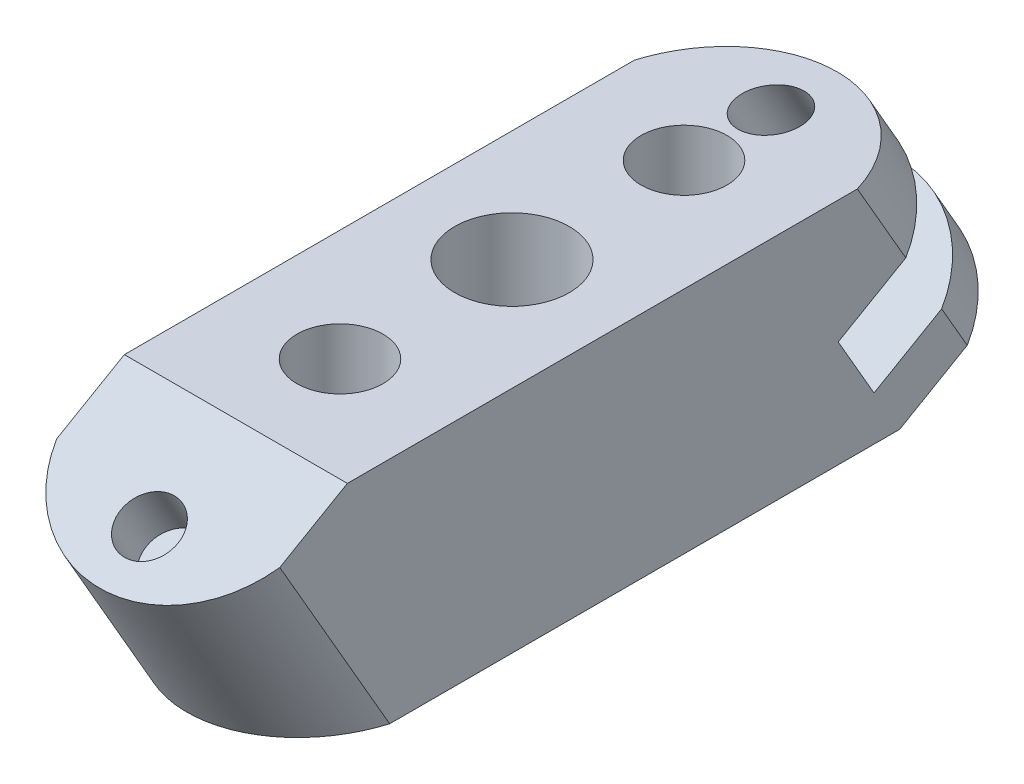
ISO-10303-21;
HEADER;
FILE_DESCRIPTION(('STEP AP214'),'2;1');
FILE_NAME('part.step','',(''),(''),'','','');
FILE_SCHEMA(('AUTOMOTIVE_DESIGN { 1 0 10303 214 1 1 1 1 }'));
ENDSEC;
DATA;
#1=APPLICATION_CONTEXT('core data for automotive mechanical design processes');
#2=APPLICATION_PROTOCOL_DEFINITION('international standard','automotive_design',2000,#1);
#3=PRODUCT_CONTEXT('',#1,'mechanical');
#4=PRODUCT('Part','Part','',(#3));
#5=PRODUCT_RELATED_PRODUCT_CATEGORY('part','',(#4));
#6=PRODUCT_DEFINITION_FORMATION('','',#4);
#7=PRODUCT_DEFINITION_CONTEXT('part definition',#1,'design');
#8=PRODUCT_DEFINITION('design','',#6,#7);
#9=PRODUCT_DEFINITION_SHAPE('','',#8);
#10=(LENGTH_UNIT() NAMED_UNIT(*) SI_UNIT(.MILLI.,.METRE.));
#11=(NAMED_UNIT(*) PLANE_ANGLE_UNIT() SI_UNIT($,.RADIAN.));
#12=(NAMED_UNIT(*) SI_UNIT($,.STERADIAN.) SOLID_ANGLE_UNIT());
#13=UNCERTAINTY_MEASURE_WITH_UNIT(LENGTH_MEASURE(1.E-05),#10,'distance_accuracy_value','');
#14=(GEOMETRIC_REPRESENTATION_CONTEXT(3) GLOBAL_UNCERTAINTY_ASSIGNED_CONTEXT((#13)) GLOBAL_UNIT_ASSIGNED_CONTEXT((#10,
#11,#12)) REPRESENTATION_CONTEXT('',''));
#15=CARTESIAN_POINT('',(0.,0.,0.));
#16=DIRECTION('',(0.,0.,1.));
#17=DIRECTION('',(1.,0.,0.));
#18=AXIS2_PLACEMENT_3D('',#15,#16,#17);
#19=CARTESIAN_POINT('',(0.,0.,0.));
#20=DIRECTION('',(0.,1.,0.));
#21=DIRECTION('',(0.,0.,1.));
#22=AXIS2_PLACEMENT_3D('',#19,#20,#21);
#23=PLANE('',#22);
#24=CARTESIAN_POINT('',(0.,0.,9.03248212926257));
#25=DIRECTION('',(0.,-1.,0.));
#26=DIRECTION('',(0.,0.,1.));
#27=AXIS2_PLACEMENT_3D('',#24,#25,#26);
#28=ELLIPSE('',#27,1.15470053837925,1.);
#29=CARTESIAN_POINT('',(0.,0.,10.1871826676418));
#30=VERTEX_POINT('',#29);
#31=EDGE_CURVE('E211',#30,#30,#28,.F.);
#32=ORIENTED_EDGE('',*,*,#31,.T.);
#33=EDGE_LOOP('',(#32));
#34=FACE_BOUND('',#33,.T.);
#35=CARTESIAN_POINT('',(0.,0.,-6.));
#36=DIRECTION('',(0.,1.,0.));
#37=DIRECTION('',(0.,0.,1.));
#38=AXIS2_PLACEMENT_3D('',#35,#36,#37);
#39=CIRCLE('',#38,1.5);
#40=CARTESIAN_POINT('',(0.,0.,-4.5));
#41=VERTEX_POINT('',#40);
#42=EDGE_CURVE('E195',#41,#41,#39,.F.);
#43=ORIENTED_EDGE('',*,*,#42,.F.);
#44=EDGE_LOOP('',(#43));
#45=FACE_BOUND('',#44,.T.);
#46=CARTESIAN_POINT('',(0.,0.,0.));
#47=DIRECTION('',(0.,1.,0.));
#48=DIRECTION('',(0.,0.,1.));
#49=AXIS2_PLACEMENT_3D('',#46,#47,#48);
#50=CIRCLE('',#49,2.);
#51=CARTESIAN_POINT('',(0.,0.,2.));
#52=VERTEX_POINT('',#51);
#53=EDGE_CURVE('E277',#52,#52,#50,.F.);
#54=ORIENTED_EDGE('',*,*,#53,.F.);
#55=EDGE_LOOP('',(#54));
#56=FACE_BOUND('',#55,.T.);
#57=CARTESIAN_POINT('',(0.,0.,6.));
#58=DIRECTION('',(0.,1.,0.));
#59=DIRECTION('',(0.,0.,1.));
#60=AXIS2_PLACEMENT_3D('',#57,#58,#59);
#61=CIRCLE('',#60,1.5);
#62=CARTESIAN_POINT('',(0.,0.,7.5));
#63=VERTEX_POINT('',#62);
#64=EDGE_CURVE('E283',#63,#63,#61,.F.);
#65=ORIENTED_EDGE('',*,*,#64,.F.);
#66=EDGE_LOOP('',(#65));
#67=FACE_BOUND('',#66,.T.);
#68=DIRECTION('',(0.,0.,-1.));
#69=VECTOR('',#68,1.);
#70=CARTESIAN_POINT('',(3.8891925564144,0.,15.960685359538));
#71=LINE('',#70,#69);
#72=CARTESIAN_POINT('',(3.8891925564144,0.,8.15562472071067));
#73=VERTEX_POINT('',#72);
#74=CARTESIAN_POINT('',(3.8891925564144,0.,-9.63108014573055));
#75=VERTEX_POINT('',#74);
#76=EDGE_CURVE('E183',#73,#75,#71,.T.);
#77=ORIENTED_EDGE('',*,*,#76,.F.);
#78=CARTESIAN_POINT('',(0.,0.,6.58395135646211));
#79=DIRECTION('',(0.,1.,0.));
#80=DIRECTION('',(0.,0.,1.));
#81=AXIS2_PLACEMENT_3D('',#78,#79,#80);
#82=ELLIPSE('',#81,4.75793184955893,4.12048985119312);
#83=CARTESIAN_POINT('',(-3.8891925564144,0.,8.15562472071067));
#84=VERTEX_POINT('',#83);
#85=EDGE_CURVE('E168',#84,#73,#82,.T.);
#86=ORIENTED_EDGE('',*,*,#85,.F.);
#87=DIRECTION('',(0.,0.,1.));
#88=VECTOR('',#87,1.);
#89=CARTESIAN_POINT('',(-3.8891925564144,0.,15.960685359538));
#90=LINE('',#89,#88);
#91=CARTESIAN_POINT('',(-3.8891925564144,0.,-9.63108014573055));
#92=VERTEX_POINT('',#91);
#93=EDGE_CURVE('E190',#92,#84,#90,.T.);
#94=ORIENTED_EDGE('',*,*,#93,.F.);
#95=DIRECTION('',(-1.,0.,0.));
#96=VECTOR('',#95,1.);
#97=CARTESIAN_POINT('',(10.7867199262881,0.,-9.63108014573055));
#98=LINE('',#97,#96);
#99=EDGE_CURVE('E188',#75,#92,#98,.T.);
#100=ORIENTED_EDGE('',*,*,#99,.F.);
#101=EDGE_LOOP('',(#77,#86,#94,#100));
#102=FACE_BOUND('',#101,.T.);
#103=ADVANCED_FACE('F87',(#34,#45,#56,#67,#102),#23,.F.);
#104=CARTESIAN_POINT('',(10.7867199262881,5.25920054445814,14.3782840560862));
#105=DIRECTION('',(0.,-0.866025403784439,-0.5));
#106=DIRECTION('',(0.,0.5,-0.866025403784439));
#107=AXIS2_PLACEMENT_3D('',#104,#105,#106);
#108=PLANE('',#107);
#109=CARTESIAN_POINT('',(0.,6.25920054445815,12.6462332485173));
#110=DIRECTION('',(0.,0.86602540378444,0.499999999999998));
#111=DIRECTION('',(0.,-0.499999999999998,0.86602540378444));
#112=AXIS2_PLACEMENT_3D('',#109,#110,#111);
#113=CIRCLE('',#112,1.);
#114=CARTESIAN_POINT('',(0.,5.75920054445815,13.5122586523018));
#115=VERTEX_POINT('',#114);
#116=EDGE_CURVE('E506',#115,#115,#113,.T.);
#117=ORIENTED_EDGE('',*,*,#116,.F.);
#118=EDGE_LOOP('',(#117));
#119=FACE_BOUND('',#118,.T.);
#120=CARTESIAN_POINT('',(0.,7.3194454700547,10.809835168917));
#121=DIRECTION('',(0.,-0.866025403784439,-0.5));
#122=DIRECTION('',(0.,0.5,-0.866025403784439));
#123=AXIS2_PLACEMENT_3D('',#120,#121,#122);
#124=CIRCLE('',#123,4.12048985119312);
#125=CARTESIAN_POINT('',(3.8891925564144,6.63889094010939,11.9885901921034));
#126=VERTEX_POINT('',#125);
#127=CARTESIAN_POINT('',(-3.8891925564144,6.63889094010939,11.9885901921034));
#128=VERTEX_POINT('',#127);
#129=EDGE_CURVE('E95',#126,#128,#124,.T.);
#130=ORIENTED_EDGE('',*,*,#129,.F.);
#131=DIRECTION('',(0.,0.5,-0.866025403784439));
#132=VECTOR('',#131,1.);
#133=CARTESIAN_POINT('',(3.8891925564144,5.25920054445814,14.3782840560862));
#134=LINE('',#133,#132);
#135=CARTESIAN_POINT('',(3.8891925564144,8.,9.63108014573055));
#136=VERTEX_POINT('',#135);
#137=EDGE_CURVE('E186',#126,#136,#134,.T.);
#138=ORIENTED_EDGE('',*,*,#137,.T.);
#139=DIRECTION('',(-1.,0.,0.));
#140=VECTOR('',#139,1.);
#141=CARTESIAN_POINT('',(10.7867199262881,8.,9.63108014573055));
#142=LINE('',#141,#140);
#143=CARTESIAN_POINT('',(-3.8891925564144,8.,9.63108014573055));
#144=VERTEX_POINT('',#143);
#145=EDGE_CURVE('E215',#136,#144,#142,.T.);
#146=ORIENTED_EDGE('',*,*,#145,.T.);
#147=DIRECTION('',(0.,-0.5,0.866025403784439));
#148=VECTOR('',#147,1.);
#149=CARTESIAN_POINT('',(-3.8891925564144,5.25920054445814,14.3782840560862));
#150=LINE('',#149,#148);
#151=EDGE_CURVE('E178',#144,#128,#150,.T.);
#152=ORIENTED_EDGE('',*,*,#151,.T.);
#153=EDGE_LOOP('',(#130,#138,#146,#152));
#154=FACE_BOUND('',#153,.T.);
#155=ADVANCED_FACE('F213',(#119,#154),#108,.F.);
#156=CARTESIAN_POINT('',(3.8891925564144,8.,15.960685359538));
#157=DIRECTION('',(-1.,0.,0.));
#158=DIRECTION('',(0.,0.,1.));
#159=AXIS2_PLACEMENT_3D('',#156,#157,#158);
#160=PLANE('',#159);
#161=DIRECTION('',(0.,0.866025403784439,0.5));
#162=VECTOR('',#161,1.);
#163=CARTESIAN_POINT('',(3.8891925564144,-9.75746872363361,2.52214752651145));
#164=LINE('',#163,#162);
#165=EDGE_CURVE('E12',#73,#126,#164,.T.);
#166=ORIENTED_EDGE('',*,*,#165,.F.);
#167=ORIENTED_EDGE('',*,*,#76,.T.);
#168=DIRECTION('',(0.,-0.5,0.866025403784439));
#169=VECTOR('',#168,1.);
#170=CARTESIAN_POINT('',(3.8891925564144,2.74079945554186,-14.3782840560862));
#171=LINE('',#170,#169);
#172=CARTESIAN_POINT('',(3.8891925564144,1.3611090598906,-11.9885901921034));
#173=VERTEX_POINT('',#172);
#174=EDGE_CURVE('E268',#173,#75,#171,.T.);
#175=ORIENTED_EDGE('',*,*,#174,.F.);
#176=DIRECTION('',(0.,-0.86602540378444,-0.499999999999998));
#177=VECTOR('',#176,1.);
#178=CARTESIAN_POINT('',(3.8891925564144,11.7593636972333,-5.98515507813138));
#179=LINE('',#178,#177);
#180=CARTESIAN_POINT('',(3.8891925564144,2.90817757738913,-11.0953897670709));
#181=VERTEX_POINT('',#180);
#182=EDGE_CURVE('E253',#181,#173,#179,.T.);
#183=ORIENTED_EDGE('',*,*,#182,.F.);
#184=DIRECTION('',(0.,-0.499999999999998,0.86602540378444));
#185=VECTOR('',#184,1.);
#186=CARTESIAN_POINT('',(3.8891925564144,2.90817757738913,-11.0953897670709));
#187=LINE('',#186,#185);
#188=CARTESIAN_POINT('',(3.8891925564144,1.54706851749852,-8.73787972069799));
#189=VERTEX_POINT('',#188);
#190=EDGE_CURVE('E237',#181,#189,#187,.T.);
#191=ORIENTED_EDGE('',*,*,#190,.T.);
#192=DIRECTION('',(0.,0.86602540378444,0.499999999999998));
#193=VECTOR('',#192,1.);
#194=CARTESIAN_POINT('',(3.8891925564144,1.54706851749852,-8.73787972069799));
#195=LINE('',#194,#193);
#196=CARTESIAN_POINT('',(3.8891925564144,3.71213202695961,-7.487879720698));
#197=VERTEX_POINT('',#196);
#198=EDGE_CURVE('E248',#189,#197,#195,.T.);
#199=ORIENTED_EDGE('',*,*,#198,.T.);
#200=DIRECTION('',(0.,-0.499999999999998,0.86602540378444));
#201=VECTOR('',#200,1.);
#202=CARTESIAN_POINT('',(3.8891925564144,5.07324108685023,-9.84538976707086));
#203=LINE('',#202,#201);
#204=CARTESIAN_POINT('',(3.8891925564144,5.07324108685023,-9.84538976707086));
#205=VERTEX_POINT('',#204);
#206=EDGE_CURVE('E229',#205,#197,#203,.T.);
#207=ORIENTED_EDGE('',*,*,#206,.F.);
#208=CARTESIAN_POINT('',(3.8891925564144,8.,-8.15562472071071));
#209=VERTEX_POINT('',#208);
#210=EDGE_CURVE('E254',#209,#205,#179,.T.);
#211=ORIENTED_EDGE('',*,*,#210,.F.);
#212=DIRECTION('',(0.,0.,-1.));
#213=VECTOR('',#212,1.);
#214=CARTESIAN_POINT('',(3.8891925564144,8.,15.960685359538));
#215=LINE('',#214,#213);
#216=EDGE_CURVE('E193',#136,#209,#215,.T.);
#217=ORIENTED_EDGE('',*,*,#216,.F.);
#218=ORIENTED_EDGE('',*,*,#137,.F.);
#219=EDGE_LOOP('',(#166,#167,#175,#183,#191,#199,#207,#211,#217,#218));
#220=FACE_BOUND('',#219,.T.);
#221=ADVANCED_FACE('F181',(#220),#160,.F.);
#222=CARTESIAN_POINT('',(-3.8891925564144,8.,15.960685359538));
#223=DIRECTION('',(1.,0.,0.));
#224=DIRECTION('',(0.,0.,-1.));
#225=AXIS2_PLACEMENT_3D('',#222,#223,#224);
#226=PLANE('',#225);
#227=DIRECTION('',(0.,0.866025403784439,0.5));
#228=VECTOR('',#227,1.);
#229=CARTESIAN_POINT('',(-3.8891925564144,-9.75746872363361,2.52214752651145));
#230=LINE('',#229,#228);
#231=EDGE_CURVE('E173',#84,#128,#230,.T.);
#232=ORIENTED_EDGE('',*,*,#231,.T.);
#233=ORIENTED_EDGE('',*,*,#151,.F.);
#234=DIRECTION('',(0.,0.,1.));
#235=VECTOR('',#234,1.);
#236=CARTESIAN_POINT('',(-3.8891925564144,8.,15.960685359538));
#237=LINE('',#236,#235);
#238=CARTESIAN_POINT('',(-3.8891925564144,8.,-8.15562472071071));
#239=VERTEX_POINT('',#238);
#240=EDGE_CURVE('E189',#239,#144,#237,.T.);
#241=ORIENTED_EDGE('',*,*,#240,.F.);
#242=DIRECTION('',(0.,-0.86602540378444,-0.499999999999998));
#243=VECTOR('',#242,1.);
#244=CARTESIAN_POINT('',(-3.8891925564144,11.7593636972333,-5.98515507813138));
#245=LINE('',#244,#243);
#246=CARTESIAN_POINT('',(-3.8891925564144,5.07324108685023,-9.84538976707086));
#247=VERTEX_POINT('',#246);
#248=EDGE_CURVE('E264',#239,#247,#245,.T.);
#249=ORIENTED_EDGE('',*,*,#248,.T.);
#250=DIRECTION('',(0.,0.499999999999998,-0.86602540378444));
#251=VECTOR('',#250,1.);
#252=CARTESIAN_POINT('',(-3.8891925564144,3.71213202695961,-7.487879720698));
#253=LINE('',#252,#251);
#254=CARTESIAN_POINT('',(-3.8891925564144,3.71213202695961,-7.487879720698));
#255=VERTEX_POINT('',#254);
#256=EDGE_CURVE('E109',#255,#247,#253,.T.);
#257=ORIENTED_EDGE('',*,*,#256,.F.);
#258=DIRECTION('',(0.,0.86602540378444,0.499999999999998));
#259=VECTOR('',#258,1.);
#260=CARTESIAN_POINT('',(-3.8891925564144,1.54706851749852,-8.73787972069799));
#261=LINE('',#260,#259);
#262=CARTESIAN_POINT('',(-3.8891925564144,1.54706851749852,-8.73787972069799));
#263=VERTEX_POINT('',#262);
#264=EDGE_CURVE('E245',#263,#255,#261,.T.);
#265=ORIENTED_EDGE('',*,*,#264,.F.);
#266=DIRECTION('',(0.,0.499999999999998,-0.86602540378444));
#267=VECTOR('',#266,1.);
#268=CARTESIAN_POINT('',(-3.8891925564144,1.54706851749852,-8.73787972069799));
#269=LINE('',#268,#267);
#270=CARTESIAN_POINT('',(-3.8891925564144,2.90817757738913,-11.0953897670709));
#271=VERTEX_POINT('',#270);
#272=EDGE_CURVE('E242',#263,#271,#269,.T.);
#273=ORIENTED_EDGE('',*,*,#272,.T.);
#274=CARTESIAN_POINT('',(-3.8891925564144,1.3611090598906,-11.9885901921034));
#275=VERTEX_POINT('',#274);
#276=EDGE_CURVE('E263',#271,#275,#245,.T.);
#277=ORIENTED_EDGE('',*,*,#276,.T.);
#278=DIRECTION('',(0.,0.5,-0.866025403784439));
#279=VECTOR('',#278,1.);
#280=CARTESIAN_POINT('',(-3.8891925564144,2.74079945554186,-14.3782840560862));
#281=LINE('',#280,#279);
#282=EDGE_CURVE('E267',#92,#275,#281,.T.);
#283=ORIENTED_EDGE('',*,*,#282,.F.);
#284=ORIENTED_EDGE('',*,*,#93,.T.);
#285=EDGE_LOOP('',(#232,#233,#241,#249,#257,#265,#273,#277,#283,#284));
#286=FACE_BOUND('',#285,.T.);
#287=ADVANCED_FACE('F89',(#286),#226,.F.);
#288=CARTESIAN_POINT('',(0.,-5.65685424949238,-6.));
#289=DIRECTION('',(0.,1.,0.));
#290=DIRECTION('',(0.,0.,1.));
#291=AXIS2_PLACEMENT_3D('',#288,#289,#290);
#292=CYLINDRICAL_SURFACE('',#291,1.5);
#293=CARTESIAN_POINT('',(0.,8.,-6.));
#294=DIRECTION('',(0.,1.,0.));
#295=DIRECTION('',(0.,0.,1.));
#296=AXIS2_PLACEMENT_3D('',#293,#294,#295);
#297=CIRCLE('',#296,1.5);
#298=CARTESIAN_POINT('',(0.,8.,-4.5));
#299=VERTEX_POINT('',#298);
#300=EDGE_CURVE('E274',#299,#299,#297,.T.);
#301=ORIENTED_EDGE('',*,*,#300,.T.);
#302=EDGE_LOOP('',(#301));
#303=FACE_BOUND('',#302,.T.);
#304=ORIENTED_EDGE('',*,*,#42,.T.);
#305=EDGE_LOOP('',(#304));
#306=FACE_BOUND('',#305,.T.);
#307=CARTESIAN_POINT('',(0.,6.28921529875994,-6.));
#308=DIRECTION('',(0.,0.499999999999998,-0.86602540378444));
#309=DIRECTION('',(0.,0.86602540378444,0.499999999999998));
#310=AXIS2_PLACEMENT_3D('',#307,#308,#309);
#311=ELLIPSE('',#310,3.00000000000001,1.5);
#312=CARTESIAN_POINT('',(-0.190299597308189,3.71213202695961,-7.487879720698));
#313=VERTEX_POINT('',#312);
#314=CARTESIAN_POINT('',(0.190299597308189,3.71213202695961,-7.487879720698));
#315=VERTEX_POINT('',#314);
#316=EDGE_CURVE('E199',#313,#315,#311,.F.);
#317=ORIENTED_EDGE('',*,*,#316,.F.);
#318=CARTESIAN_POINT('',(0.,2.85310426969285,-6.));
#319=DIRECTION('',(0.,-0.86602540378444,-0.499999999999998));
#320=DIRECTION('',(0.,0.499999999999998,-0.86602540378444));
#321=AXIS2_PLACEMENT_3D('',#318,#319,#320);
#322=ELLIPSE('',#321,1.73205080756888,1.5);
#323=EDGE_CURVE('E251',#315,#313,#322,.F.);
#324=ORIENTED_EDGE('',*,*,#323,.F.);
#325=EDGE_LOOP('',(#317,#324));
#326=FACE_BOUND('',#325,.T.);
#327=ADVANCED_FACE('F344',(#303,#306,#326),#292,.F.);
#328=CARTESIAN_POINT('',(0.,11.078809167288,-4.80640005494495));
#329=DIRECTION('',(0.,-0.86602540378444,-0.499999999999998));
#330=DIRECTION('',(0.,0.499999999999998,-0.86602540378444));
#331=AXIS2_PLACEMENT_3D('',#328,#329,#330);
#332=CYLINDRICAL_SURFACE('',#331,4.12048985119312);
#333=CARTESIAN_POINT('',(0.,4.39268655690492,-8.66663474388443));
#334=DIRECTION('',(0.,-0.86602540378444,-0.499999999999998));
#335=DIRECTION('',(0.,0.499999999999998,-0.86602540378444));
#336=AXIS2_PLACEMENT_3D('',#333,#334,#335);
#337=CIRCLE('',#336,4.12048985119312);
#338=EDGE_CURVE('E227',#247,#205,#337,.T.);
#339=ORIENTED_EDGE('',*,*,#338,.F.);
#340=ORIENTED_EDGE('',*,*,#248,.F.);
#341=CARTESIAN_POINT('',(0.,8.,-6.58395135646214));
#342=DIRECTION('',(0.,1.,0.));
#343=DIRECTION('',(0.,0.,-1.));
#344=AXIS2_PLACEMENT_3D('',#341,#342,#343);
#345=ELLIPSE('',#344,4.75793184955893,4.12048985119312);
#346=EDGE_CURVE('E260',#209,#239,#345,.T.);
#347=ORIENTED_EDGE('',*,*,#346,.F.);
#348=ORIENTED_EDGE('',*,*,#210,.T.);
#349=EDGE_LOOP('',(#339,#340,#347,#348));
#350=FACE_BOUND('',#349,.T.);
#351=ADVANCED_FACE('F295',(#350),#332,.T.);
#352=CARTESIAN_POINT('',(0.,8.,0.));
#353=DIRECTION('',(0.,1.,0.));
#354=DIRECTION('',(0.,0.,1.));
#355=AXIS2_PLACEMENT_3D('',#352,#353,#354);
#356=PLANE('',#355);
#357=ORIENTED_EDGE('',*,*,#145,.F.);
#358=ORIENTED_EDGE('',*,*,#216,.T.);
#359=ORIENTED_EDGE('',*,*,#346,.T.);
#360=ORIENTED_EDGE('',*,*,#240,.T.);
#361=EDGE_LOOP('',(#357,#358,#359,#360));
#362=FACE_BOUND('',#361,.T.);
#363=CARTESIAN_POINT('',(0.,8.,-9.03248212926257));
#364=DIRECTION('',(0.,1.,0.));
#365=DIRECTION('',(0.,0.,-1.));
#366=AXIS2_PLACEMENT_3D('',#363,#364,#365);
#367=ELLIPSE('',#366,1.15470053837925,1.);
#368=CARTESIAN_POINT('',(0.,8.,-10.1871826676418));
#369=VERTEX_POINT('',#368);
#370=EDGE_CURVE('E204',#369,#369,#367,.F.);
#371=ORIENTED_EDGE('',*,*,#370,.T.);
#372=EDGE_LOOP('',(#371));
#373=FACE_BOUND('',#372,.T.);
#374=ORIENTED_EDGE('',*,*,#300,.F.);
#375=EDGE_LOOP('',(#374));
#376=FACE_BOUND('',#375,.T.);
#377=CARTESIAN_POINT('',(0.,8.,0.));
#378=DIRECTION('',(0.,1.,0.));
#379=DIRECTION('',(0.,0.,1.));
#380=AXIS2_PLACEMENT_3D('',#377,#378,#379);
#381=CIRCLE('',#380,2.);
#382=CARTESIAN_POINT('',(0.,8.,2.));
#383=VERTEX_POINT('',#382);
#384=EDGE_CURVE('E280',#383,#383,#381,.T.);
#385=ORIENTED_EDGE('',*,*,#384,.F.);
#386=EDGE_LOOP('',(#385));
#387=FACE_BOUND('',#386,.T.);
#388=CARTESIAN_POINT('',(0.,8.,6.));
#389=DIRECTION('',(0.,1.,0.));
#390=DIRECTION('',(0.,0.,1.));
#391=AXIS2_PLACEMENT_3D('',#388,#389,#390);
#392=CIRCLE('',#391,1.5);
#393=CARTESIAN_POINT('',(0.,8.,7.5));
#394=VERTEX_POINT('',#393);
#395=EDGE_CURVE('E270',#394,#394,#392,.T.);
#396=ORIENTED_EDGE('',*,*,#395,.F.);
#397=EDGE_LOOP('',(#396));
#398=FACE_BOUND('',#397,.T.);
#399=ADVANCED_FACE('F291',(#362,#373,#376,#387,#398),#356,.T.);
#400=CARTESIAN_POINT('',(0.,-5.65685424949238,6.));
#401=DIRECTION('',(0.,1.,0.));
#402=DIRECTION('',(0.,0.,1.));
#403=AXIS2_PLACEMENT_3D('',#400,#401,#402);
#404=CYLINDRICAL_SURFACE('',#403,1.5);
#405=ORIENTED_EDGE('',*,*,#64,.T.);
#406=EDGE_LOOP('',(#405));
#407=FACE_BOUND('',#406,.T.);
#408=ORIENTED_EDGE('',*,*,#395,.T.);
#409=EDGE_LOOP('',(#408));
#410=FACE_BOUND('',#409,.T.);
#411=ADVANCED_FACE('F323',(#407,#410),#404,.F.);
#412=CARTESIAN_POINT('',(0.,-5.65685424949238,0.));
#413=DIRECTION('',(0.,1.,0.));
#414=DIRECTION('',(0.,0.,1.));
#415=AXIS2_PLACEMENT_3D('',#412,#413,#414);
#416=CYLINDRICAL_SURFACE('',#415,2.);
#417=ORIENTED_EDGE('',*,*,#53,.T.);
#418=EDGE_LOOP('',(#417));
#419=FACE_BOUND('',#418,.T.);
#420=ORIENTED_EDGE('',*,*,#384,.T.);
#421=EDGE_LOOP('',(#420));
#422=FACE_BOUND('',#421,.T.);
#423=ADVANCED_FACE('F315',(#419,#422),#416,.F.);
#424=CARTESIAN_POINT('',(10.7867199262881,2.74079945554186,-14.3782840560862));
#425=DIRECTION('',(0.,0.866025403784439,0.5));
#426=DIRECTION('',(0.,-0.5,0.866025403784439));
#427=AXIS2_PLACEMENT_3D('',#424,#425,#426);
#428=PLANE('',#427);
#429=CARTESIAN_POINT('',(0.,1.74079945554185,-12.6462332485173));
#430=DIRECTION('',(0.,-0.86602540378444,-0.499999999999998));
#431=DIRECTION('',(0.,0.499999999999998,-0.86602540378444));
#432=AXIS2_PLACEMENT_3D('',#429,#430,#431);
#433=CIRCLE('',#432,1.);
#434=CARTESIAN_POINT('',(0.,2.24079945554185,-13.5122586523018));
#435=VERTEX_POINT('',#434);
#436=EDGE_CURVE('E220',#435,#435,#433,.T.);
#437=ORIENTED_EDGE('',*,*,#436,.F.);
#438=EDGE_LOOP('',(#437));
#439=FACE_BOUND('',#438,.T.);
#440=CARTESIAN_POINT('',(0.,0.680554529945292,-10.809835168917));
#441=DIRECTION('',(0.,-0.86602540378444,-0.499999999999998));
#442=DIRECTION('',(0.,0.499999999999998,-0.86602540378444));
#443=AXIS2_PLACEMENT_3D('',#440,#441,#442);
#444=CIRCLE('',#443,4.12048985119312);
#445=EDGE_CURVE('E257',#173,#275,#444,.F.);
#446=ORIENTED_EDGE('',*,*,#445,.F.);
#447=ORIENTED_EDGE('',*,*,#174,.T.);
#448=ORIENTED_EDGE('',*,*,#99,.T.);
#449=ORIENTED_EDGE('',*,*,#282,.T.);
#450=EDGE_LOOP('',(#446,#447,#448,#449));
#451=FACE_BOUND('',#450,.T.);
#452=ADVANCED_FACE('F313',(#439,#451),#428,.F.);
#453=ORIENTED_EDGE('',*,*,#276,.F.);
#454=CARTESIAN_POINT('',(0.,2.22762304744382,-9.91663474388442));
#455=DIRECTION('',(0.,-0.86602540378444,-0.499999999999998));
#456=DIRECTION('',(0.,0.499999999999998,-0.86602540378444));
#457=AXIS2_PLACEMENT_3D('',#454,#455,#456);
#458=CIRCLE('',#457,4.12048985119312);
#459=EDGE_CURVE('E234',#271,#181,#458,.T.);
#460=ORIENTED_EDGE('',*,*,#459,.T.);
#461=ORIENTED_EDGE('',*,*,#182,.T.);
#462=ORIENTED_EDGE('',*,*,#445,.T.);
#463=EDGE_LOOP('',(#453,#460,#461,#462));
#464=FACE_BOUND('',#463,.T.);
#465=ADVANCED_FACE('F310',(#464),#332,.T.);
#466=CARTESIAN_POINT('',(3.8891925564144,1.54706851749852,-8.73787972069799));
#467=DIRECTION('',(0.,0.499999999999998,-0.86602540378444));
#468=DIRECTION('',(0.,0.86602540378444,0.499999999999998));
#469=AXIS2_PLACEMENT_3D('',#466,#467,#468);
#470=PLANE('',#469);
#471=ORIENTED_EDGE('',*,*,#316,.T.);
#472=DIRECTION('',(-1.,0.,0.));
#473=VECTOR('',#472,1.);
#474=CARTESIAN_POINT('',(3.8891925564144,3.71213202695961,-7.487879720698));
#475=LINE('',#474,#473);
#476=EDGE_CURVE('E102',#197,#315,#475,.T.);
#477=ORIENTED_EDGE('',*,*,#476,.F.);
#478=ORIENTED_EDGE('',*,*,#198,.F.);
#479=DIRECTION('',(-1.,0.,0.));
#480=VECTOR('',#479,1.);
#481=CARTESIAN_POINT('',(3.8891925564144,1.54706851749852,-8.73787972069799));
#482=LINE('',#481,#480);
#483=EDGE_CURVE('E240',#189,#263,#482,.T.);
#484=ORIENTED_EDGE('',*,*,#483,.T.);
#485=ORIENTED_EDGE('',*,*,#264,.T.);
#486=EDGE_CURVE('E231',#313,#255,#475,.T.);
#487=ORIENTED_EDGE('',*,*,#486,.F.);
#488=EDGE_LOOP('',(#471,#477,#478,#484,#485,#487));
#489=FACE_BOUND('',#488,.T.);
#490=ADVANCED_FACE('F303',(#489),#470,.T.);
#491=CARTESIAN_POINT('',(0.,4.39268655690492,-8.66663474388443));
#492=DIRECTION('',(0.,-0.86602540378444,-0.499999999999998));
#493=DIRECTION('',(0.,0.499999999999998,-0.86602540378444));
#494=AXIS2_PLACEMENT_3D('',#491,#492,#493);
#495=PLANE('',#494);
#496=CARTESIAN_POINT('',(0.,5.45293148250148,-10.5030328234848));
#497=DIRECTION('',(0.,-0.86602540378444,-0.499999999999998));
#498=DIRECTION('',(0.,0.499999999999998,-0.86602540378444));
#499=AXIS2_PLACEMENT_3D('',#496,#497,#498);
#500=CIRCLE('',#499,1.);
#501=CARTESIAN_POINT('',(0.,5.95293148250148,-11.3690582272692));
#502=VERTEX_POINT('',#501);
#503=EDGE_CURVE('E203',#502,#502,#500,.T.);
#504=ORIENTED_EDGE('',*,*,#503,.F.);
#505=EDGE_LOOP('',(#504));
#506=FACE_BOUND('',#505,.T.);
#507=ORIENTED_EDGE('',*,*,#323,.T.);
#508=ORIENTED_EDGE('',*,*,#486,.T.);
#509=ORIENTED_EDGE('',*,*,#256,.T.);
#510=ORIENTED_EDGE('',*,*,#338,.T.);
#511=ORIENTED_EDGE('',*,*,#206,.T.);
#512=ORIENTED_EDGE('',*,*,#476,.T.);
#513=EDGE_LOOP('',(#507,#508,#509,#510,#511,#512));
#514=FACE_BOUND('',#513,.T.);
#515=ADVANCED_FACE('F297',(#506,#514),#495,.T.);
#516=CARTESIAN_POINT('',(0.,2.22762304744382,-9.91663474388442));
#517=DIRECTION('',(0.,-0.86602540378444,-0.499999999999998));
#518=DIRECTION('',(0.,0.499999999999998,-0.86602540378444));
#519=AXIS2_PLACEMENT_3D('',#516,#517,#518);
#520=PLANE('',#519);
#521=CARTESIAN_POINT('',(0.,3.28786797304038,-11.7530328234848));
#522=DIRECTION('',(0.,-0.86602540378444,-0.499999999999998));
#523=DIRECTION('',(0.,0.499999999999998,-0.86602540378444));
#524=AXIS2_PLACEMENT_3D('',#521,#522,#523);
#525=CIRCLE('',#524,1.);
#526=CARTESIAN_POINT('',(0.,3.78786797304038,-12.6190582272692));
#527=VERTEX_POINT('',#526);
#528=EDGE_CURVE('E201',#527,#527,#525,.T.);
#529=ORIENTED_EDGE('',*,*,#528,.T.);
#530=EDGE_LOOP('',(#529));
#531=FACE_BOUND('',#530,.T.);
#532=ORIENTED_EDGE('',*,*,#459,.F.);
#533=ORIENTED_EDGE('',*,*,#272,.F.);
#534=ORIENTED_EDGE('',*,*,#483,.F.);
#535=ORIENTED_EDGE('',*,*,#190,.F.);
#536=EDGE_LOOP('',(#532,#533,#534,#535));
#537=FACE_BOUND('',#536,.T.);
#538=ADVANCED_FACE('F307',(#531,#537),#520,.F.);
#539=CARTESIAN_POINT('',(0.,10.6389584337647,-7.5088787671483));
#540=DIRECTION('',(0.,-0.86602540378444,-0.499999999999998));
#541=DIRECTION('',(0.,0.499999999999998,-0.86602540378444));
#542=AXIS2_PLACEMENT_3D('',#539,#540,#541);
#543=CYLINDRICAL_SURFACE('',#542,1.);
#544=ORIENTED_EDGE('',*,*,#436,.T.);
#545=EDGE_LOOP('',(#544));
#546=FACE_BOUND('',#545,.T.);
#547=ORIENTED_EDGE('',*,*,#528,.F.);
#548=EDGE_LOOP('',(#547));
#549=FACE_BOUND('',#548,.T.);
#550=ADVANCED_FACE('F412',(#546,#549),#543,.F.);
#551=ORIENTED_EDGE('',*,*,#503,.T.);
#552=EDGE_LOOP('',(#551));
#553=FACE_BOUND('',#552,.T.);
#554=ORIENTED_EDGE('',*,*,#370,.F.);
#555=EDGE_LOOP('',(#554));
#556=FACE_BOUND('',#555,.T.);
#557=ADVANCED_FACE('F421',(#553,#556),#543,.F.);
#558=CARTESIAN_POINT('',(0.,-9.07691419368831,1.34339250332503));
#559=DIRECTION('',(0.,0.866025403784439,0.5));
#560=DIRECTION('',(0.,-0.5,0.866025403784439));
#561=AXIS2_PLACEMENT_3D('',#558,#559,#560);
#562=CYLINDRICAL_SURFACE('',#561,4.12048985119312);
#563=ORIENTED_EDGE('',*,*,#85,.T.);
#564=ORIENTED_EDGE('',*,*,#165,.T.);
#565=ORIENTED_EDGE('',*,*,#129,.T.);
#566=ORIENTED_EDGE('',*,*,#231,.F.);
#567=EDGE_LOOP('',(#563,#564,#565,#566));
#568=FACE_BOUND('',#567,.T.);
#569=ADVANCED_FACE('F170',(#568),#562,.T.);
#570=CARTESIAN_POINT('',(0.,3.60731344309508,8.66663474388443));
#571=DIRECTION('',(0.,0.86602540378444,0.499999999999998));
#572=DIRECTION('',(0.,-0.499999999999998,0.86602540378444));
#573=AXIS2_PLACEMENT_3D('',#570,#571,#572);
#574=PLANE('',#573);
#575=CARTESIAN_POINT('',(0.,2.54706851749852,10.5030328234848));
#576=DIRECTION('',(0.,0.86602540378444,0.499999999999998));
#577=DIRECTION('',(0.,-0.499999999999998,0.86602540378444));
#578=AXIS2_PLACEMENT_3D('',#575,#576,#577);
#579=CIRCLE('',#578,1.);
#580=CARTESIAN_POINT('',(0.,2.04706851749852,11.3690582272692));
#581=VERTEX_POINT('',#580);
#582=EDGE_CURVE('E510',#581,#581,#579,.T.);
#583=ORIENTED_EDGE('',*,*,#582,.F.);
#584=EDGE_LOOP('',(#583));
#585=FACE_BOUND('',#584,.T.);
#586=ADVANCED_FACE('F439',(#585),#574,.F.);
#587=CARTESIAN_POINT('',(0.,-2.63895843376469,7.5088787671483));
#588=DIRECTION('',(0.,0.86602540378444,0.499999999999998));
#589=DIRECTION('',(0.,-0.499999999999998,0.86602540378444));
#590=AXIS2_PLACEMENT_3D('',#587,#588,#589);
#591=CYLINDRICAL_SURFACE('',#590,1.);
#592=ORIENTED_EDGE('',*,*,#582,.T.);
#593=EDGE_LOOP('',(#592));
#594=FACE_BOUND('',#593,.T.);
#595=ORIENTED_EDGE('',*,*,#31,.F.);
#596=EDGE_LOOP('',(#595));
#597=FACE_BOUND('',#596,.T.);
#598=ADVANCED_FACE('F446',(#594,#597),#591,.F.);
#599=CARTESIAN_POINT('',(0.,5.77237695255618,9.91663474388442));
#600=DIRECTION('',(0.,0.86602540378444,0.499999999999998));
#601=DIRECTION('',(0.,-0.499999999999998,0.86602540378444));
#602=AXIS2_PLACEMENT_3D('',#599,#600,#601);
#603=PLANE('',#602);
#604=CARTESIAN_POINT('',(0.,4.71213202695962,11.7530328234848));
#605=DIRECTION('',(0.,0.86602540378444,0.499999999999998));
#606=DIRECTION('',(0.,-0.499999999999998,0.86602540378444));
#607=AXIS2_PLACEMENT_3D('',#604,#605,#606);
#608=CIRCLE('',#607,1.);
#609=CARTESIAN_POINT('',(0.,4.21213202695962,12.6190582272692));
#610=VERTEX_POINT('',#609);
#611=EDGE_CURVE('E509',#610,#610,#608,.T.);
#612=ORIENTED_EDGE('',*,*,#611,.T.);
#613=EDGE_LOOP('',(#612));
#614=FACE_BOUND('',#613,.T.);
#615=ADVANCED_FACE('F455',(#614),#603,.T.);
#616=CARTESIAN_POINT('',(0.,-2.63895843376469,7.5088787671483));
#617=DIRECTION('',(0.,0.86602540378444,0.499999999999998));
#618=DIRECTION('',(0.,-0.499999999999998,0.86602540378444));
#619=AXIS2_PLACEMENT_3D('',#616,#617,#618);
#620=CYLINDRICAL_SURFACE('',#619,1.);
#621=ORIENTED_EDGE('',*,*,#116,.T.);
#622=EDGE_LOOP('',(#621));
#623=FACE_BOUND('',#622,.T.);
#624=ORIENTED_EDGE('',*,*,#611,.F.);
#625=EDGE_LOOP('',(#624));
#626=FACE_BOUND('',#625,.T.);
#627=ADVANCED_FACE('F463',(#623,#626),#620,.F.);
#628=CLOSED_SHELL('',(#103,#155,#221,#287,#327,#351,#399,#411,#423,#452,#465,#490,#515,#538,
#550,#557,#569,#586,#598,#615,#627));
#629=MANIFOLD_SOLID_BREP('B2',#628);
#630=ADVANCED_BREP_SHAPE_REPRESENTATION('',(#18,#629),#14);
#631=SHAPE_DEFINITION_REPRESENTATION(#9,#630);
ENDSEC;
END-ISO-10303-21;
